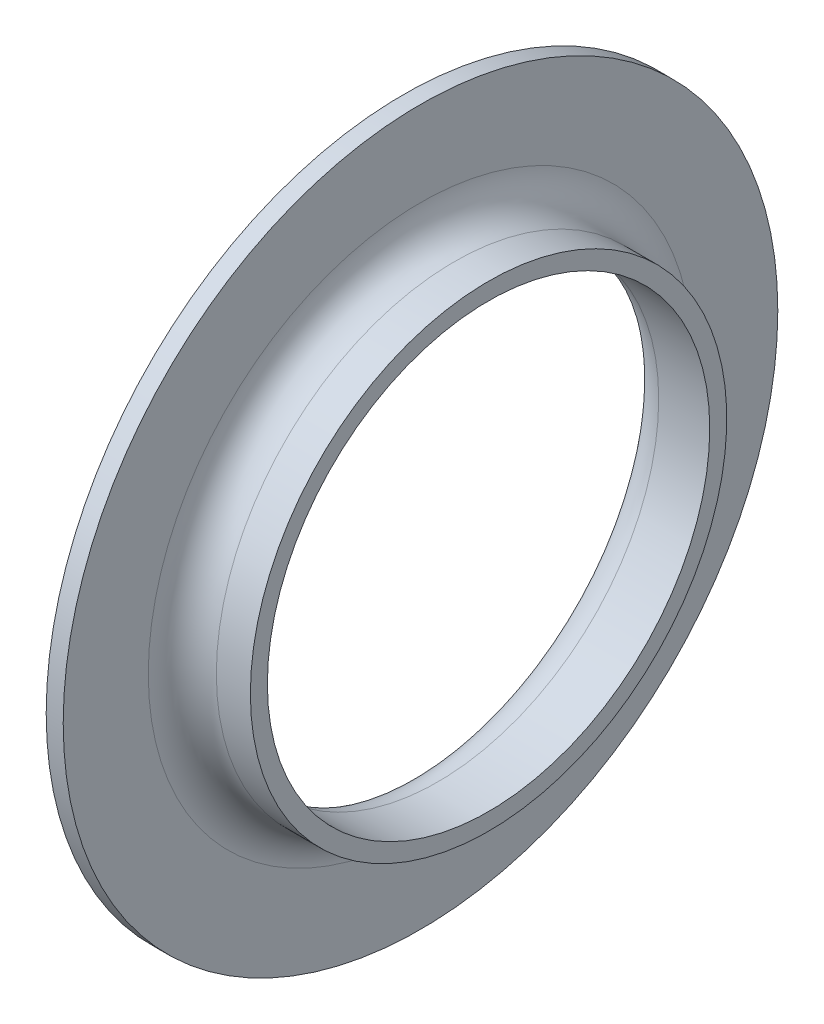
ISO-10303-21;
HEADER;
FILE_DESCRIPTION(('STEP AP214'),'2;1');
FILE_NAME('part.step','',(''),(''),'','','');
FILE_SCHEMA(('AUTOMOTIVE_DESIGN { 1 0 10303 214 1 1 1 1 }'));
ENDSEC;
DATA;
#1=APPLICATION_CONTEXT('core data for automotive mechanical design processes');
#2=APPLICATION_PROTOCOL_DEFINITION('international standard','automotive_design',2000,#1);
#3=PRODUCT_CONTEXT('',#1,'mechanical');
#4=PRODUCT('Part','Part','',(#3));
#5=PRODUCT_RELATED_PRODUCT_CATEGORY('part','',(#4));
#6=PRODUCT_DEFINITION_FORMATION('','',#4);
#7=PRODUCT_DEFINITION_CONTEXT('part definition',#1,'design');
#8=PRODUCT_DEFINITION('design','',#6,#7);
#9=PRODUCT_DEFINITION_SHAPE('','',#8);
#10=(LENGTH_UNIT() NAMED_UNIT(*) SI_UNIT(.MILLI.,.METRE.));
#11=(NAMED_UNIT(*) PLANE_ANGLE_UNIT() SI_UNIT($,.RADIAN.));
#12=(NAMED_UNIT(*) SI_UNIT($,.STERADIAN.) SOLID_ANGLE_UNIT());
#13=UNCERTAINTY_MEASURE_WITH_UNIT(LENGTH_MEASURE(1.E-05),#10,'distance_accuracy_value','');
#14=(GEOMETRIC_REPRESENTATION_CONTEXT(3) GLOBAL_UNCERTAINTY_ASSIGNED_CONTEXT((#13)) GLOBAL_UNIT_ASSIGNED_CONTEXT((#10,
#11,#12)) REPRESENTATION_CONTEXT('',''));
#15=CARTESIAN_POINT('',(0.,0.,0.));
#16=DIRECTION('',(0.,0.,1.));
#17=DIRECTION('',(1.,0.,0.));
#18=AXIS2_PLACEMENT_3D('',#15,#16,#17);
#19=CARTESIAN_POINT('',(0.,0.,0.));
#20=DIRECTION('',(-1.,0.,0.));
#21=DIRECTION('',(0.,0.,1.));
#22=AXIS2_PLACEMENT_3D('',#19,#20,#21);
#23=CYLINDRICAL_SURFACE('',#22,21.);
#24=CARTESIAN_POINT('',(0.,0.,0.));
#25=DIRECTION('',(-1.,0.,0.));
#26=DIRECTION('',(0.,0.,1.));
#27=AXIS2_PLACEMENT_3D('',#24,#25,#26);
#28=CIRCLE('',#27,21.);
#29=CARTESIAN_POINT('',(0.,0.,21.));
#30=VERTEX_POINT('',#29);
#31=EDGE_CURVE('E62',#30,#30,#28,.T.);
#32=ORIENTED_EDGE('',*,*,#31,.F.);
#33=EDGE_LOOP('',(#32));
#34=FACE_BOUND('',#33,.T.);
#35=CARTESIAN_POINT('',(1.,0.,0.));
#36=DIRECTION('',(-1.,0.,0.));
#37=DIRECTION('',(0.,0.,1.));
#38=AXIS2_PLACEMENT_3D('',#35,#36,#37);
#39=CIRCLE('',#38,21.);
#40=CARTESIAN_POINT('',(1.,0.,21.));
#41=VERTEX_POINT('',#40);
#42=EDGE_CURVE('E10',#41,#41,#39,.T.);
#43=ORIENTED_EDGE('',*,*,#42,.T.);
#44=EDGE_LOOP('',(#43));
#45=FACE_BOUND('',#44,.T.);
#46=ADVANCED_FACE('F34',(#34,#45),#23,.T.);
#47=CARTESIAN_POINT('',(1.,16.,0.));
#48=DIRECTION('',(-1.,0.,0.));
#49=DIRECTION('',(0.,0.,1.));
#50=AXIS2_PLACEMENT_3D('',#47,#48,#49);
#51=PLANE('',#50);
#52=ORIENTED_EDGE('',*,*,#42,.F.);
#53=EDGE_LOOP('',(#52));
#54=FACE_BOUND('',#53,.T.);
#55=CARTESIAN_POINT('',(1.,0.,0.));
#56=DIRECTION('',(-1.,0.,0.));
#57=DIRECTION('',(0.,0.,1.));
#58=AXIS2_PLACEMENT_3D('',#55,#56,#57);
#59=CIRCLE('',#58,16.);
#60=CARTESIAN_POINT('',(1.,0.,16.));
#61=VERTEX_POINT('',#60);
#62=EDGE_CURVE('E40',#61,#61,#59,.T.);
#63=ORIENTED_EDGE('',*,*,#62,.T.);
#64=EDGE_LOOP('',(#63));
#65=FACE_BOUND('',#64,.T.);
#66=ADVANCED_FACE('F69',(#54,#65),#51,.F.);
#67=CARTESIAN_POINT('',(3.,0.,0.));
#68=DIRECTION('',(-1.,0.,0.));
#69=DIRECTION('',(0.,0.,1.));
#70=AXIS2_PLACEMENT_3D('',#67,#68,#69);
#71=TOROIDAL_SURFACE('',#70,16.,2.);
#72=ORIENTED_EDGE('',*,*,#62,.F.);
#73=EDGE_LOOP('',(#72));
#74=FACE_BOUND('',#73,.T.);
#75=CARTESIAN_POINT('',(3.00000000000002,0.,0.));
#76=DIRECTION('',(-1.,0.,0.));
#77=DIRECTION('',(0.,0.,1.));
#78=AXIS2_PLACEMENT_3D('',#75,#76,#77);
#79=CIRCLE('',#78,14.);
#80=CARTESIAN_POINT('',(3.00000000000002,0.,14.));
#81=VERTEX_POINT('',#80);
#82=EDGE_CURVE('E44',#81,#81,#79,.T.);
#83=ORIENTED_EDGE('',*,*,#82,.T.);
#84=EDGE_LOOP('',(#83));
#85=FACE_BOUND('',#84,.T.);
#86=ADVANCED_FACE('F73',(#74,#85),#71,.F.);
#87=CARTESIAN_POINT('',(0.,0.,0.));
#88=DIRECTION('',(-1.,0.,0.));
#89=DIRECTION('',(0.,0.,1.));
#90=AXIS2_PLACEMENT_3D('',#87,#88,#89);
#91=CYLINDRICAL_SURFACE('',#90,14.);
#92=ORIENTED_EDGE('',*,*,#82,.F.);
#93=EDGE_LOOP('',(#92));
#94=FACE_BOUND('',#93,.T.);
#95=CARTESIAN_POINT('',(5.,0.,0.));
#96=DIRECTION('',(-1.,0.,0.));
#97=DIRECTION('',(0.,0.,1.));
#98=AXIS2_PLACEMENT_3D('',#95,#96,#97);
#99=CIRCLE('',#98,14.);
#100=CARTESIAN_POINT('',(5.,0.,14.));
#101=VERTEX_POINT('',#100);
#102=EDGE_CURVE('E48',#101,#101,#99,.T.);
#103=ORIENTED_EDGE('',*,*,#102,.T.);
#104=EDGE_LOOP('',(#103));
#105=FACE_BOUND('',#104,.T.);
#106=ADVANCED_FACE('F78',(#94,#105),#91,.T.);
#107=CARTESIAN_POINT('',(5.,13.,0.));
#108=DIRECTION('',(-1.,0.,0.));
#109=DIRECTION('',(0.,0.,1.));
#110=AXIS2_PLACEMENT_3D('',#107,#108,#109);
#111=PLANE('',#110);
#112=ORIENTED_EDGE('',*,*,#102,.F.);
#113=EDGE_LOOP('',(#112));
#114=FACE_BOUND('',#113,.T.);
#115=CARTESIAN_POINT('',(5.,0.,0.));
#116=DIRECTION('',(-1.,0.,0.));
#117=DIRECTION('',(0.,0.,1.));
#118=AXIS2_PLACEMENT_3D('',#115,#116,#117);
#119=CIRCLE('',#118,13.);
#120=CARTESIAN_POINT('',(5.,0.,13.));
#121=VERTEX_POINT('',#120);
#122=EDGE_CURVE('E53',#121,#121,#119,.T.);
#123=ORIENTED_EDGE('',*,*,#122,.T.);
#124=EDGE_LOOP('',(#123));
#125=FACE_BOUND('',#124,.T.);
#126=ADVANCED_FACE('F84',(#114,#125),#111,.F.);
#127=CARTESIAN_POINT('',(0.,0.,0.));
#128=DIRECTION('',(-1.,0.,0.));
#129=DIRECTION('',(0.,0.,1.));
#130=AXIS2_PLACEMENT_3D('',#127,#128,#129);
#131=CYLINDRICAL_SURFACE('',#130,13.);
#132=ORIENTED_EDGE('',*,*,#122,.F.);
#133=EDGE_LOOP('',(#132));
#134=FACE_BOUND('',#133,.T.);
#135=CARTESIAN_POINT('',(2.00000000000002,0.,0.));
#136=DIRECTION('',(-1.,0.,0.));
#137=DIRECTION('',(0.,0.,1.));
#138=AXIS2_PLACEMENT_3D('',#135,#136,#137);
#139=CIRCLE('',#138,13.);
#140=CARTESIAN_POINT('',(2.00000000000002,0.,13.));
#141=VERTEX_POINT('',#140);
#142=EDGE_CURVE('E56',#141,#141,#139,.T.);
#143=ORIENTED_EDGE('',*,*,#142,.T.);
#144=EDGE_LOOP('',(#143));
#145=FACE_BOUND('',#144,.T.);
#146=ADVANCED_FACE('F88',(#134,#145),#131,.F.);
#147=CARTESIAN_POINT('',(2.,0.,0.));
#148=DIRECTION('',(-1.,0.,0.));
#149=DIRECTION('',(0.,0.,1.));
#150=AXIS2_PLACEMENT_3D('',#147,#148,#149);
#151=TOROIDAL_SURFACE('',#150,15.,2.);
#152=ORIENTED_EDGE('',*,*,#142,.F.);
#153=EDGE_LOOP('',(#152));
#154=FACE_BOUND('',#153,.T.);
#155=CARTESIAN_POINT('',(0.,0.,0.));
#156=DIRECTION('',(-1.,0.,0.));
#157=DIRECTION('',(0.,0.,1.));
#158=AXIS2_PLACEMENT_3D('',#155,#156,#157);
#159=CIRCLE('',#158,15.);
#160=CARTESIAN_POINT('',(0.,0.,15.));
#161=VERTEX_POINT('',#160);
#162=EDGE_CURVE('E59',#161,#161,#159,.T.);
#163=ORIENTED_EDGE('',*,*,#162,.T.);
#164=EDGE_LOOP('',(#163));
#165=FACE_BOUND('',#164,.T.);
#166=ADVANCED_FACE('F92',(#154,#165),#151,.T.);
#167=CARTESIAN_POINT('',(0.,21.,0.));
#168=DIRECTION('',(1.,0.,0.));
#169=DIRECTION('',(0.,0.,-1.));
#170=AXIS2_PLACEMENT_3D('',#167,#168,#169);
#171=PLANE('',#170);
#172=ORIENTED_EDGE('',*,*,#162,.F.);
#173=EDGE_LOOP('',(#172));
#174=FACE_BOUND('',#173,.T.);
#175=ORIENTED_EDGE('',*,*,#31,.T.);
#176=EDGE_LOOP('',(#175));
#177=FACE_BOUND('',#176,.T.);
#178=ADVANCED_FACE('F66',(#174,#177),#171,.F.);
#179=CLOSED_SHELL('',(#46,#66,#86,#106,#126,#146,#166,#178));
#180=MANIFOLD_SOLID_BREP('B2',#179);
#181=ADVANCED_BREP_SHAPE_REPRESENTATION('',(#18,#180),#14);
#182=SHAPE_DEFINITION_REPRESENTATION(#9,#181);
ENDSEC;
END-ISO-10303-21;
